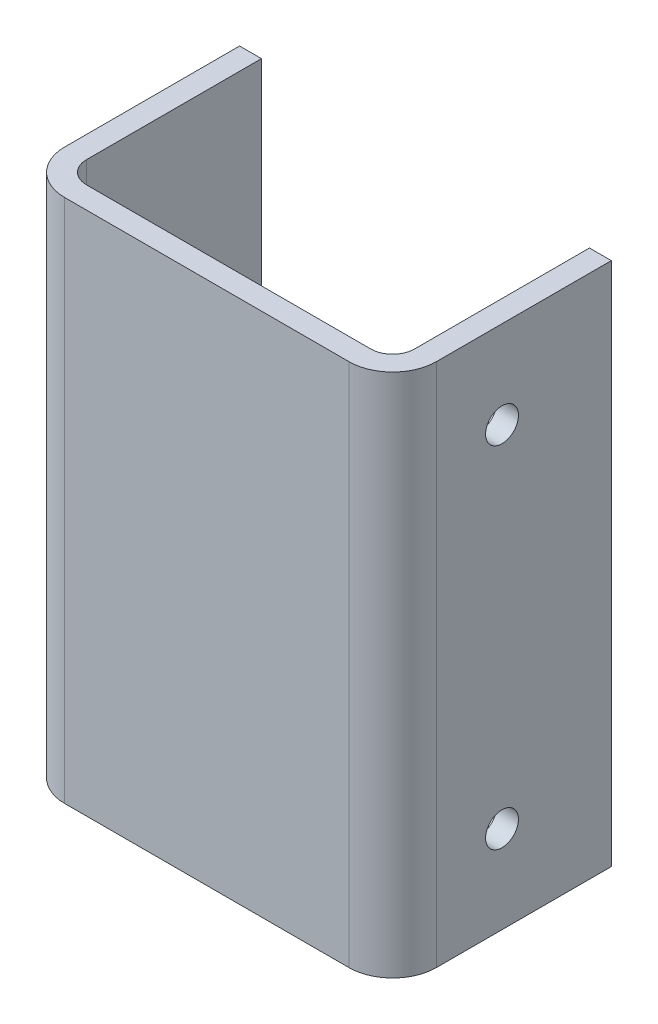
ISO-10303-21;
HEADER;
FILE_DESCRIPTION(('STEP AP214'),'2;1');
FILE_NAME('part.step','',(''),(''),'','','');
FILE_SCHEMA(('AUTOMOTIVE_DESIGN { 1 0 10303 214 1 1 1 1 }'));
ENDSEC;
DATA;
#1=APPLICATION_CONTEXT('core data for automotive mechanical design processes');
#2=APPLICATION_PROTOCOL_DEFINITION('international standard','automotive_design',2000,#1);
#3=PRODUCT_CONTEXT('',#1,'mechanical');
#4=PRODUCT('Part','Part','',(#3));
#5=PRODUCT_RELATED_PRODUCT_CATEGORY('part','',(#4));
#6=PRODUCT_DEFINITION_FORMATION('','',#4);
#7=PRODUCT_DEFINITION_CONTEXT('part definition',#1,'design');
#8=PRODUCT_DEFINITION('design','',#6,#7);
#9=PRODUCT_DEFINITION_SHAPE('','',#8);
#10=(LENGTH_UNIT() NAMED_UNIT(*) SI_UNIT(.MILLI.,.METRE.));
#11=(NAMED_UNIT(*) PLANE_ANGLE_UNIT() SI_UNIT($,.RADIAN.));
#12=(NAMED_UNIT(*) SI_UNIT($,.STERADIAN.) SOLID_ANGLE_UNIT());
#13=UNCERTAINTY_MEASURE_WITH_UNIT(LENGTH_MEASURE(1.E-05),#10,'distance_accuracy_value','');
#14=(GEOMETRIC_REPRESENTATION_CONTEXT(3) GLOBAL_UNCERTAINTY_ASSIGNED_CONTEXT((#13)) GLOBAL_UNIT_ASSIGNED_CONTEXT((#10,
#11,#12)) REPRESENTATION_CONTEXT('',''));
#15=CARTESIAN_POINT('',(0.,0.,0.));
#16=DIRECTION('',(0.,0.,1.));
#17=DIRECTION('',(1.,0.,0.));
#18=AXIS2_PLACEMENT_3D('',#15,#16,#17);
#19=CARTESIAN_POINT('',(0.,63.5,-15.875));
#20=DIRECTION('',(1.,0.,0.));
#21=DIRECTION('',(0.,0.,-1.));
#22=AXIS2_PLACEMENT_3D('',#19,#20,#21);
#23=CYLINDRICAL_SURFACE('',#22,2.3876);
#24=CARTESIAN_POINT('',(-3.175,63.5,-15.875));
#25=DIRECTION('',(1.,0.,0.));
#26=DIRECTION('',(0.,0.,-1.));
#27=AXIS2_PLACEMENT_3D('',#24,#25,#26);
#28=CIRCLE('',#27,2.3876);
#29=CARTESIAN_POINT('',(-3.175,63.5,-18.2626));
#30=VERTEX_POINT('',#29);
#31=EDGE_CURVE('E160',#30,#30,#28,.T.);
#32=ORIENTED_EDGE('',*,*,#31,.F.);
#33=EDGE_LOOP('',(#32));
#34=FACE_BOUND('',#33,.T.);
#35=CARTESIAN_POINT('',(0.,63.5,-15.875));
#36=DIRECTION('',(1.,0.,0.));
#37=DIRECTION('',(0.,0.,-1.));
#38=AXIS2_PLACEMENT_3D('',#35,#36,#37);
#39=CIRCLE('',#38,2.3876);
#40=CARTESIAN_POINT('',(0.,63.5,-18.2626));
#41=VERTEX_POINT('',#40);
#42=EDGE_CURVE('E20',#41,#41,#39,.F.);
#43=ORIENTED_EDGE('',*,*,#42,.F.);
#44=EDGE_LOOP('',(#43));
#45=FACE_BOUND('',#44,.T.);
#46=ADVANCED_FACE('F17',(#34,#45),#23,.F.);
#47=CARTESIAN_POINT('',(0.,12.7,-15.875));
#48=DIRECTION('',(1.,0.,0.));
#49=DIRECTION('',(0.,0.,-1.));
#50=AXIS2_PLACEMENT_3D('',#47,#48,#49);
#51=CYLINDRICAL_SURFACE('',#50,2.3876);
#52=CARTESIAN_POINT('',(-3.175,12.7,-15.875));
#53=DIRECTION('',(1.,0.,0.));
#54=DIRECTION('',(0.,0.,-1.));
#55=AXIS2_PLACEMENT_3D('',#52,#53,#54);
#56=CIRCLE('',#55,2.3876);
#57=CARTESIAN_POINT('',(-3.175,12.7,-18.2626));
#58=VERTEX_POINT('',#57);
#59=EDGE_CURVE('E157',#58,#58,#56,.T.);
#60=ORIENTED_EDGE('',*,*,#59,.F.);
#61=EDGE_LOOP('',(#60));
#62=FACE_BOUND('',#61,.T.);
#63=CARTESIAN_POINT('',(0.,12.7,-15.875));
#64=DIRECTION('',(1.,0.,0.));
#65=DIRECTION('',(0.,0.,-1.));
#66=AXIS2_PLACEMENT_3D('',#63,#64,#65);
#67=CIRCLE('',#66,2.3876);
#68=CARTESIAN_POINT('',(0.,12.7,-18.2626));
#69=VERTEX_POINT('',#68);
#70=EDGE_CURVE('E163',#69,#69,#67,.F.);
#71=ORIENTED_EDGE('',*,*,#70,.F.);
#72=EDGE_LOOP('',(#71));
#73=FACE_BOUND('',#72,.T.);
#74=ADVANCED_FACE('F398',(#62,#73),#51,.F.);
#75=CARTESIAN_POINT('',(-6.35,175.53432,-6.35));
#76=DIRECTION('',(0.,-1.,0.));
#77=DIRECTION('',(0.,0.,-1.));
#78=AXIS2_PLACEMENT_3D('',#75,#76,#77);
#79=CYLINDRICAL_SURFACE('',#78,6.35);
#80=DIRECTION('',(0.,1.,0.));
#81=VECTOR('',#80,1.);
#82=CARTESIAN_POINT('',(-6.35,0.,0.));
#83=LINE('',#82,#81);
#84=CARTESIAN_POINT('',(-6.35,0.,0.));
#85=VERTEX_POINT('',#84);
#86=CARTESIAN_POINT('',(-6.35,76.2,0.));
#87=VERTEX_POINT('',#86);
#88=EDGE_CURVE('E199',#85,#87,#83,.T.);
#89=ORIENTED_EDGE('',*,*,#88,.F.);
#90=CARTESIAN_POINT('',(-6.35,0.,-6.35));
#91=DIRECTION('',(0.,-1.,0.));
#92=DIRECTION('',(0.,0.,-1.));
#93=AXIS2_PLACEMENT_3D('',#90,#91,#92);
#94=CIRCLE('',#93,6.35);
#95=CARTESIAN_POINT('',(0.,0.,-6.35));
#96=VERTEX_POINT('',#95);
#97=EDGE_CURVE('E143',#85,#96,#94,.F.);
#98=ORIENTED_EDGE('',*,*,#97,.T.);
#99=DIRECTION('',(0.,1.,0.));
#100=VECTOR('',#99,1.);
#101=CARTESIAN_POINT('',(0.,0.,-6.35));
#102=LINE('',#101,#100);
#103=CARTESIAN_POINT('',(0.,76.2,-6.35));
#104=VERTEX_POINT('',#103);
#105=EDGE_CURVE('E171',#104,#96,#102,.F.);
#106=ORIENTED_EDGE('',*,*,#105,.F.);
#107=CARTESIAN_POINT('',(-6.35,76.2,-6.35));
#108=DIRECTION('',(0.,-1.,0.));
#109=DIRECTION('',(0.,0.,-1.));
#110=AXIS2_PLACEMENT_3D('',#107,#108,#109);
#111=CIRCLE('',#110,6.35);
#112=EDGE_CURVE('E149',#87,#104,#111,.F.);
#113=ORIENTED_EDGE('',*,*,#112,.F.);
#114=EDGE_LOOP('',(#89,#98,#106,#113));
#115=FACE_BOUND('',#114,.T.);
#116=ADVANCED_FACE('F268',(#115),#79,.T.);
#117=CARTESIAN_POINT('',(0.,0.,0.));
#118=DIRECTION('',(1.,0.,0.));
#119=DIRECTION('',(0.,0.,-1.));
#120=AXIS2_PLACEMENT_3D('',#117,#118,#119);
#121=PLANE('',#120);
#122=ORIENTED_EDGE('',*,*,#70,.T.);
#123=EDGE_LOOP('',(#122));
#124=FACE_BOUND('',#123,.T.);
#125=ORIENTED_EDGE('',*,*,#42,.T.);
#126=EDGE_LOOP('',(#125));
#127=FACE_BOUND('',#126,.T.);
#128=DIRECTION('',(0.,0.,1.));
#129=VECTOR('',#128,1.);
#130=CARTESIAN_POINT('',(0.,76.2,0.));
#131=LINE('',#130,#129);
#132=CARTESIAN_POINT('',(0.,76.2,-31.75));
#133=VERTEX_POINT('',#132);
#134=EDGE_CURVE('E190',#104,#133,#131,.F.);
#135=ORIENTED_EDGE('',*,*,#134,.F.);
#136=ORIENTED_EDGE('',*,*,#105,.T.);
#137=DIRECTION('',(0.,0.,1.));
#138=VECTOR('',#137,1.);
#139=CARTESIAN_POINT('',(0.,0.,0.));
#140=LINE('',#139,#138);
#141=CARTESIAN_POINT('',(0.,0.,-31.75));
#142=VERTEX_POINT('',#141);
#143=EDGE_CURVE('E145',#96,#142,#140,.F.);
#144=ORIENTED_EDGE('',*,*,#143,.T.);
#145=DIRECTION('',(0.,1.,0.));
#146=VECTOR('',#145,1.);
#147=CARTESIAN_POINT('',(0.,0.,-31.75));
#148=LINE('',#147,#146);
#149=EDGE_CURVE('E165',#133,#142,#148,.F.);
#150=ORIENTED_EDGE('',*,*,#149,.F.);
#151=EDGE_LOOP('',(#135,#136,#144,#150));
#152=FACE_BOUND('',#151,.T.);
#153=ADVANCED_FACE('F383',(#124,#127,#152),#121,.T.);
#154=CARTESIAN_POINT('',(0.,0.,-31.75));
#155=DIRECTION('',(0.,0.,-1.));
#156=DIRECTION('',(-1.,0.,0.));
#157=AXIS2_PLACEMENT_3D('',#154,#155,#156);
#158=PLANE('',#157);
#159=ORIENTED_EDGE('',*,*,#149,.T.);
#160=DIRECTION('',(1.,0.,0.));
#161=VECTOR('',#160,1.);
#162=CARTESIAN_POINT('',(0.,0.,-31.75));
#163=LINE('',#162,#161);
#164=CARTESIAN_POINT('',(-3.175,0.,-31.75));
#165=VERTEX_POINT('',#164);
#166=EDGE_CURVE('E224',#142,#165,#163,.F.);
#167=ORIENTED_EDGE('',*,*,#166,.T.);
#168=DIRECTION('',(0.,1.,0.));
#169=VECTOR('',#168,1.);
#170=CARTESIAN_POINT('',(-3.175,0.,-31.75));
#171=LINE('',#170,#169);
#172=CARTESIAN_POINT('',(-3.175,76.2,-31.75));
#173=VERTEX_POINT('',#172);
#174=EDGE_CURVE('E162',#173,#165,#171,.F.);
#175=ORIENTED_EDGE('',*,*,#174,.F.);
#176=DIRECTION('',(1.,0.,0.));
#177=VECTOR('',#176,1.);
#178=CARTESIAN_POINT('',(0.,76.2,-31.75));
#179=LINE('',#178,#177);
#180=EDGE_CURVE('E187',#133,#173,#179,.F.);
#181=ORIENTED_EDGE('',*,*,#180,.F.);
#182=EDGE_LOOP('',(#159,#167,#175,#181));
#183=FACE_BOUND('',#182,.T.);
#184=ADVANCED_FACE('F263',(#183),#158,.T.);
#185=CARTESIAN_POINT('',(-3.175,0.,-31.75));
#186=DIRECTION('',(-1.,0.,0.));
#187=DIRECTION('',(0.,0.,1.));
#188=AXIS2_PLACEMENT_3D('',#185,#186,#187);
#189=PLANE('',#188);
#190=ORIENTED_EDGE('',*,*,#59,.T.);
#191=EDGE_LOOP('',(#190));
#192=FACE_BOUND('',#191,.T.);
#193=ORIENTED_EDGE('',*,*,#31,.T.);
#194=EDGE_LOOP('',(#193));
#195=FACE_BOUND('',#194,.T.);
#196=DIRECTION('',(0.,0.,1.));
#197=VECTOR('',#196,1.);
#198=CARTESIAN_POINT('',(-3.175,0.,0.));
#199=LINE('',#198,#197);
#200=CARTESIAN_POINT('',(-3.175,0.,-6.35));
#201=VERTEX_POINT('',#200);
#202=EDGE_CURVE('E142',#165,#201,#199,.T.);
#203=ORIENTED_EDGE('',*,*,#202,.T.);
#204=DIRECTION('',(0.,1.,0.));
#205=VECTOR('',#204,1.);
#206=CARTESIAN_POINT('',(-3.175,-99.33432,-6.35));
#207=LINE('',#206,#205);
#208=CARTESIAN_POINT('',(-3.175,76.2,-6.35));
#209=VERTEX_POINT('',#208);
#210=EDGE_CURVE('E148',#201,#209,#207,.T.);
#211=ORIENTED_EDGE('',*,*,#210,.T.);
#212=DIRECTION('',(0.,0.,1.));
#213=VECTOR('',#212,1.);
#214=CARTESIAN_POINT('',(-3.175,76.2,0.));
#215=LINE('',#214,#213);
#216=EDGE_CURVE('E189',#173,#209,#215,.T.);
#217=ORIENTED_EDGE('',*,*,#216,.F.);
#218=ORIENTED_EDGE('',*,*,#174,.T.);
#219=EDGE_LOOP('',(#203,#211,#217,#218));
#220=FACE_BOUND('',#219,.T.);
#221=ADVANCED_FACE('F262',(#192,#195,#220),#189,.T.);
#222=CARTESIAN_POINT('',(-50.8,0.,-31.75));
#223=DIRECTION('',(0.,0.,-1.));
#224=DIRECTION('',(-1.,0.,0.));
#225=AXIS2_PLACEMENT_3D('',#222,#223,#224);
#226=PLANE('',#225);
#227=DIRECTION('',(0.,1.,0.));
#228=VECTOR('',#227,1.);
#229=CARTESIAN_POINT('',(-50.8,0.,-31.75));
#230=LINE('',#229,#228);
#231=CARTESIAN_POINT('',(-50.8,0.,-31.75));
#232=VERTEX_POINT('',#231);
#233=CARTESIAN_POINT('',(-50.8,76.2,-31.75));
#234=VERTEX_POINT('',#233);
#235=EDGE_CURVE('E197',#232,#234,#230,.T.);
#236=ORIENTED_EDGE('',*,*,#235,.F.);
#237=DIRECTION('',(1.,0.,0.));
#238=VECTOR('',#237,1.);
#239=CARTESIAN_POINT('',(0.,0.,-31.75));
#240=LINE('',#239,#238);
#241=CARTESIAN_POINT('',(-53.975,0.,-31.75));
#242=VERTEX_POINT('',#241);
#243=EDGE_CURVE('E127',#232,#242,#240,.F.);
#244=ORIENTED_EDGE('',*,*,#243,.T.);
#245=DIRECTION('',(0.,1.,0.));
#246=VECTOR('',#245,1.);
#247=CARTESIAN_POINT('',(-53.975,0.,-31.75));
#248=LINE('',#247,#246);
#249=CARTESIAN_POINT('',(-53.975,76.2,-31.75));
#250=VERTEX_POINT('',#249);
#251=EDGE_CURVE('E92',#250,#242,#248,.F.);
#252=ORIENTED_EDGE('',*,*,#251,.F.);
#253=DIRECTION('',(1.,0.,0.));
#254=VECTOR('',#253,1.);
#255=CARTESIAN_POINT('',(0.,76.2,-31.75));
#256=LINE('',#255,#254);
#257=EDGE_CURVE('E182',#234,#250,#256,.F.);
#258=ORIENTED_EDGE('',*,*,#257,.F.);
#259=EDGE_LOOP('',(#236,#244,#252,#258));
#260=FACE_BOUND('',#259,.T.);
#261=ADVANCED_FACE('F290',(#260),#226,.T.);
#262=CARTESIAN_POINT('',(-53.975,0.,-31.75));
#263=DIRECTION('',(-1.,0.,0.));
#264=DIRECTION('',(0.,0.,1.));
#265=AXIS2_PLACEMENT_3D('',#262,#263,#264);
#266=PLANE('',#265);
#267=DIRECTION('',(0.,0.,1.));
#268=VECTOR('',#267,1.);
#269=CARTESIAN_POINT('',(-53.975,0.,0.));
#270=LINE('',#269,#268);
#271=CARTESIAN_POINT('',(-53.975,0.,-6.35));
#272=VERTEX_POINT('',#271);
#273=EDGE_CURVE('E140',#242,#272,#270,.T.);
#274=ORIENTED_EDGE('',*,*,#273,.T.);
#275=DIRECTION('',(0.,-1.,0.));
#276=VECTOR('',#275,1.);
#277=CARTESIAN_POINT('',(-53.975,175.53432,-6.35));
#278=LINE('',#277,#276);
#279=CARTESIAN_POINT('',(-53.975,76.2,-6.35));
#280=VERTEX_POINT('',#279);
#281=EDGE_CURVE('E82',#280,#272,#278,.T.);
#282=ORIENTED_EDGE('',*,*,#281,.F.);
#283=DIRECTION('',(0.,0.,1.));
#284=VECTOR('',#283,1.);
#285=CARTESIAN_POINT('',(-53.975,76.2,0.));
#286=LINE('',#285,#284);
#287=EDGE_CURVE('E156',#250,#280,#286,.T.);
#288=ORIENTED_EDGE('',*,*,#287,.F.);
#289=ORIENTED_EDGE('',*,*,#251,.T.);
#290=EDGE_LOOP('',(#274,#282,#288,#289));
#291=FACE_BOUND('',#290,.T.);
#292=ADVANCED_FACE('F279',(#291),#266,.T.);
#293=CARTESIAN_POINT('',(-47.625,175.53432,-6.35));
#294=DIRECTION('',(0.,-1.,0.));
#295=DIRECTION('',(0.,0.,-1.));
#296=AXIS2_PLACEMENT_3D('',#293,#294,#295);
#297=CYLINDRICAL_SURFACE('',#296,6.35);
#298=ORIENTED_EDGE('',*,*,#281,.T.);
#299=CARTESIAN_POINT('',(-47.625,0.,-6.35));
#300=DIRECTION('',(0.,-1.,0.));
#301=DIRECTION('',(0.,0.,-1.));
#302=AXIS2_PLACEMENT_3D('',#299,#300,#301);
#303=CIRCLE('',#302,6.35);
#304=CARTESIAN_POINT('',(-47.625,0.,0.));
#305=VERTEX_POINT('',#304);
#306=EDGE_CURVE('E138',#272,#305,#303,.F.);
#307=ORIENTED_EDGE('',*,*,#306,.T.);
#308=DIRECTION('',(0.,1.,0.));
#309=VECTOR('',#308,1.);
#310=CARTESIAN_POINT('',(-47.625,0.,0.));
#311=LINE('',#310,#309);
#312=CARTESIAN_POINT('',(-47.625,76.2,0.));
#313=VERTEX_POINT('',#312);
#314=EDGE_CURVE('E206',#313,#305,#311,.F.);
#315=ORIENTED_EDGE('',*,*,#314,.F.);
#316=CARTESIAN_POINT('',(-47.625,76.2,-6.35));
#317=DIRECTION('',(0.,-1.,0.));
#318=DIRECTION('',(0.,0.,-1.));
#319=AXIS2_PLACEMENT_3D('',#316,#317,#318);
#320=CIRCLE('',#319,6.35);
#321=EDGE_CURVE('E153',#280,#313,#320,.F.);
#322=ORIENTED_EDGE('',*,*,#321,.F.);
#323=EDGE_LOOP('',(#298,#307,#315,#322));
#324=FACE_BOUND('',#323,.T.);
#325=ADVANCED_FACE('F281',(#324),#297,.T.);
#326=CARTESIAN_POINT('',(-53.975,0.,0.));
#327=DIRECTION('',(0.,0.,1.));
#328=DIRECTION('',(1.,0.,0.));
#329=AXIS2_PLACEMENT_3D('',#326,#327,#328);
#330=PLANE('',#329);
#331=DIRECTION('',(1.,0.,0.));
#332=VECTOR('',#331,1.);
#333=CARTESIAN_POINT('',(0.,0.,0.));
#334=LINE('',#333,#332);
#335=EDGE_CURVE('E122',#305,#85,#334,.T.);
#336=ORIENTED_EDGE('',*,*,#335,.T.);
#337=ORIENTED_EDGE('',*,*,#88,.T.);
#338=DIRECTION('',(1.,0.,0.));
#339=VECTOR('',#338,1.);
#340=CARTESIAN_POINT('',(0.,76.2,0.));
#341=LINE('',#340,#339);
#342=EDGE_CURVE('E152',#313,#87,#341,.T.);
#343=ORIENTED_EDGE('',*,*,#342,.F.);
#344=ORIENTED_EDGE('',*,*,#314,.T.);
#345=EDGE_LOOP('',(#336,#337,#343,#344));
#346=FACE_BOUND('',#345,.T.);
#347=ADVANCED_FACE('F272',(#346),#330,.T.);
#348=CARTESIAN_POINT('',(-50.8,0.,-3.175));
#349=DIRECTION('',(1.,0.,0.));
#350=DIRECTION('',(0.,0.,-1.));
#351=AXIS2_PLACEMENT_3D('',#348,#349,#350);
#352=PLANE('',#351);
#353=DIRECTION('',(0.,0.,1.));
#354=VECTOR('',#353,1.);
#355=CARTESIAN_POINT('',(-50.8,76.2,0.));
#356=LINE('',#355,#354);
#357=CARTESIAN_POINT('',(-50.8,76.2,-6.35));
#358=VERTEX_POINT('',#357);
#359=EDGE_CURVE('E112',#358,#234,#356,.F.);
#360=ORIENTED_EDGE('',*,*,#359,.F.);
#361=DIRECTION('',(0.,1.,0.));
#362=VECTOR('',#361,1.);
#363=CARTESIAN_POINT('',(-50.8,-99.33432,-6.35));
#364=LINE('',#363,#362);
#365=CARTESIAN_POINT('',(-50.8,0.,-6.35));
#366=VERTEX_POINT('',#365);
#367=EDGE_CURVE('E116',#358,#366,#364,.F.);
#368=ORIENTED_EDGE('',*,*,#367,.T.);
#369=DIRECTION('',(0.,0.,1.));
#370=VECTOR('',#369,1.);
#371=CARTESIAN_POINT('',(-50.8,0.,0.));
#372=LINE('',#371,#370);
#373=EDGE_CURVE('E118',#366,#232,#372,.F.);
#374=ORIENTED_EDGE('',*,*,#373,.T.);
#375=ORIENTED_EDGE('',*,*,#235,.T.);
#376=EDGE_LOOP('',(#360,#368,#374,#375));
#377=FACE_BOUND('',#376,.T.);
#378=ADVANCED_FACE('F117',(#377),#352,.T.);
#379=CARTESIAN_POINT('',(0.,76.2,0.));
#380=DIRECTION('',(0.,1.,0.));
#381=DIRECTION('',(0.,0.,1.));
#382=AXIS2_PLACEMENT_3D('',#379,#380,#381);
#383=PLANE('',#382);
#384=ORIENTED_EDGE('',*,*,#342,.T.);
#385=ORIENTED_EDGE('',*,*,#112,.T.);
#386=ORIENTED_EDGE('',*,*,#134,.T.);
#387=ORIENTED_EDGE('',*,*,#180,.T.);
#388=ORIENTED_EDGE('',*,*,#216,.T.);
#389=CARTESIAN_POINT('',(-6.35,76.2,-6.35));
#390=DIRECTION('',(0.,1.,0.));
#391=DIRECTION('',(0.,0.,1.));
#392=AXIS2_PLACEMENT_3D('',#389,#390,#391);
#393=CIRCLE('',#392,3.175);
#394=CARTESIAN_POINT('',(-6.35,76.2,-3.175));
#395=VERTEX_POINT('',#394);
#396=EDGE_CURVE('E146',#209,#395,#393,.F.);
#397=ORIENTED_EDGE('',*,*,#396,.T.);
#398=DIRECTION('',(-1.,0.,0.));
#399=VECTOR('',#398,1.);
#400=CARTESIAN_POINT('',(-3.175,76.2,-3.175));
#401=LINE('',#400,#399);
#402=CARTESIAN_POINT('',(-47.625,76.2,-3.175));
#403=VERTEX_POINT('',#402);
#404=EDGE_CURVE('E134',#403,#395,#401,.F.);
#405=ORIENTED_EDGE('',*,*,#404,.F.);
#406=CARTESIAN_POINT('',(-47.625,76.2,-6.35));
#407=DIRECTION('',(0.,1.,0.));
#408=DIRECTION('',(0.,0.,1.));
#409=AXIS2_PLACEMENT_3D('',#406,#407,#408);
#410=CIRCLE('',#409,3.175);
#411=EDGE_CURVE('E132',#403,#358,#410,.F.);
#412=ORIENTED_EDGE('',*,*,#411,.T.);
#413=ORIENTED_EDGE('',*,*,#359,.T.);
#414=ORIENTED_EDGE('',*,*,#257,.T.);
#415=ORIENTED_EDGE('',*,*,#287,.T.);
#416=ORIENTED_EDGE('',*,*,#321,.T.);
#417=EDGE_LOOP('',(#384,#385,#386,#387,#388,#397,#405,#412,#413,#414,#415,#416));
#418=FACE_BOUND('',#417,.T.);
#419=ADVANCED_FACE('F250',(#418),#383,.T.);
#420=CARTESIAN_POINT('',(-6.35,-99.33432,-6.35));
#421=DIRECTION('',(0.,1.,0.));
#422=DIRECTION('',(0.,0.,1.));
#423=AXIS2_PLACEMENT_3D('',#420,#421,#422);
#424=CYLINDRICAL_SURFACE('',#423,3.175);
#425=ORIENTED_EDGE('',*,*,#210,.F.);
#426=CARTESIAN_POINT('',(-6.35,0.,-6.35));
#427=DIRECTION('',(0.,1.,0.));
#428=DIRECTION('',(0.,0.,1.));
#429=AXIS2_PLACEMENT_3D('',#426,#427,#428);
#430=CIRCLE('',#429,3.175);
#431=CARTESIAN_POINT('',(-6.35,0.,-3.175));
#432=VERTEX_POINT('',#431);
#433=EDGE_CURVE('E128',#201,#432,#430,.F.);
#434=ORIENTED_EDGE('',*,*,#433,.T.);
#435=DIRECTION('',(0.,1.,0.));
#436=VECTOR('',#435,1.);
#437=CARTESIAN_POINT('',(-6.35,0.,-3.175));
#438=LINE('',#437,#436);
#439=EDGE_CURVE('E236',#395,#432,#438,.F.);
#440=ORIENTED_EDGE('',*,*,#439,.F.);
#441=ORIENTED_EDGE('',*,*,#396,.F.);
#442=EDGE_LOOP('',(#425,#434,#440,#441));
#443=FACE_BOUND('',#442,.T.);
#444=ADVANCED_FACE('F258',(#443),#424,.F.);
#445=CARTESIAN_POINT('',(0.,0.,0.));
#446=DIRECTION('',(0.,1.,0.));
#447=DIRECTION('',(0.,0.,1.));
#448=AXIS2_PLACEMENT_3D('',#445,#446,#447);
#449=PLANE('',#448);
#450=ORIENTED_EDGE('',*,*,#306,.F.);
#451=ORIENTED_EDGE('',*,*,#273,.F.);
#452=ORIENTED_EDGE('',*,*,#243,.F.);
#453=ORIENTED_EDGE('',*,*,#373,.F.);
#454=CARTESIAN_POINT('',(-47.625,0.,-6.35));
#455=DIRECTION('',(0.,1.,0.));
#456=DIRECTION('',(0.,0.,1.));
#457=AXIS2_PLACEMENT_3D('',#454,#455,#456);
#458=CIRCLE('',#457,3.175);
#459=CARTESIAN_POINT('',(-47.625,0.,-3.175));
#460=VERTEX_POINT('',#459);
#461=EDGE_CURVE('E35',#366,#460,#458,.T.);
#462=ORIENTED_EDGE('',*,*,#461,.T.);
#463=DIRECTION('',(-1.,0.,0.));
#464=VECTOR('',#463,1.);
#465=CARTESIAN_POINT('',(-3.175,0.,-3.175));
#466=LINE('',#465,#464);
#467=EDGE_CURVE('E26',#432,#460,#466,.T.);
#468=ORIENTED_EDGE('',*,*,#467,.F.);
#469=ORIENTED_EDGE('',*,*,#433,.F.);
#470=ORIENTED_EDGE('',*,*,#202,.F.);
#471=ORIENTED_EDGE('',*,*,#166,.F.);
#472=ORIENTED_EDGE('',*,*,#143,.F.);
#473=ORIENTED_EDGE('',*,*,#97,.F.);
#474=ORIENTED_EDGE('',*,*,#335,.F.);
#475=EDGE_LOOP('',(#450,#451,#452,#453,#462,#468,#469,#470,#471,#472,#473,#474));
#476=FACE_BOUND('',#475,.T.);
#477=ADVANCED_FACE('F125',(#476),#449,.F.);
#478=CARTESIAN_POINT('',(-47.625,-99.33432,-6.35));
#479=DIRECTION('',(0.,1.,0.));
#480=DIRECTION('',(0.,0.,1.));
#481=AXIS2_PLACEMENT_3D('',#478,#479,#480);
#482=CYLINDRICAL_SURFACE('',#481,3.175);
#483=DIRECTION('',(0.,1.,0.));
#484=VECTOR('',#483,1.);
#485=CARTESIAN_POINT('',(-47.625,0.,-3.175));
#486=LINE('',#485,#484);
#487=EDGE_CURVE('E11',#460,#403,#486,.T.);
#488=ORIENTED_EDGE('',*,*,#487,.F.);
#489=ORIENTED_EDGE('',*,*,#461,.F.);
#490=ORIENTED_EDGE('',*,*,#367,.F.);
#491=ORIENTED_EDGE('',*,*,#411,.F.);
#492=EDGE_LOOP('',(#488,#489,#490,#491));
#493=FACE_BOUND('',#492,.T.);
#494=ADVANCED_FACE('F130',(#493),#482,.F.);
#495=CARTESIAN_POINT('',(-3.175,0.,-3.175));
#496=DIRECTION('',(0.,0.,-1.));
#497=DIRECTION('',(-1.,0.,0.));
#498=AXIS2_PLACEMENT_3D('',#495,#496,#497);
#499=PLANE('',#498);
#500=ORIENTED_EDGE('',*,*,#467,.T.);
#501=ORIENTED_EDGE('',*,*,#487,.T.);
#502=ORIENTED_EDGE('',*,*,#404,.T.);
#503=ORIENTED_EDGE('',*,*,#439,.T.);
#504=EDGE_LOOP('',(#500,#501,#502,#503));
#505=FACE_BOUND('',#504,.T.);
#506=ADVANCED_FACE('F252',(#505),#499,.T.);
#507=CLOSED_SHELL('',(#46,#74,#116,#153,#184,#221,#261,#292,#325,#347,#378,#419,#444,#477,#494,#506));
#508=MANIFOLD_SOLID_BREP('B1',#507);
#509=ADVANCED_BREP_SHAPE_REPRESENTATION('',(#18,#508),#14);
#510=SHAPE_DEFINITION_REPRESENTATION(#9,#509);
ENDSEC;
END-ISO-10303-21;
